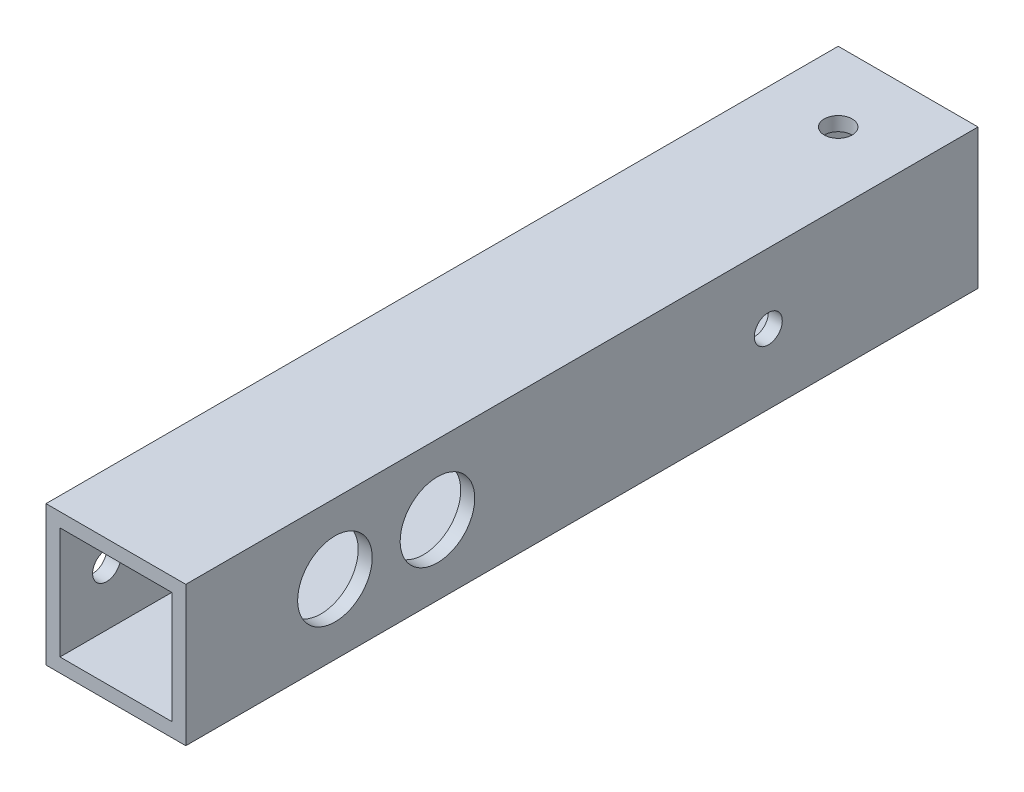
ISO-10303-21;
HEADER;
FILE_DESCRIPTION(('STEP AP214'),'2;1');
FILE_NAME('part.step','',(''),(''),'','','');
FILE_SCHEMA(('AUTOMOTIVE_DESIGN { 1 0 10303 214 1 1 1 1 }'));
ENDSEC;
DATA;
#1=APPLICATION_CONTEXT('core data for automotive mechanical design processes');
#2=APPLICATION_PROTOCOL_DEFINITION('international standard','automotive_design',2000,#1);
#3=PRODUCT_CONTEXT('',#1,'mechanical');
#4=PRODUCT('Part','Part','',(#3));
#5=PRODUCT_RELATED_PRODUCT_CATEGORY('part','',(#4));
#6=PRODUCT_DEFINITION_FORMATION('','',#4);
#7=PRODUCT_DEFINITION_CONTEXT('part definition',#1,'design');
#8=PRODUCT_DEFINITION('design','',#6,#7);
#9=PRODUCT_DEFINITION_SHAPE('','',#8);
#10=(LENGTH_UNIT() NAMED_UNIT(*) SI_UNIT(.MILLI.,.METRE.));
#11=(NAMED_UNIT(*) PLANE_ANGLE_UNIT() SI_UNIT($,.RADIAN.));
#12=(NAMED_UNIT(*) SI_UNIT($,.STERADIAN.) SOLID_ANGLE_UNIT());
#13=UNCERTAINTY_MEASURE_WITH_UNIT(LENGTH_MEASURE(1.E-05),#10,'distance_accuracy_value','');
#14=(GEOMETRIC_REPRESENTATION_CONTEXT(3) GLOBAL_UNCERTAINTY_ASSIGNED_CONTEXT((#13)) GLOBAL_UNIT_ASSIGNED_CONTEXT((#10,
#11,#12)) REPRESENTATION_CONTEXT('',''));
#15=CARTESIAN_POINT('',(0.,0.,0.));
#16=DIRECTION('',(0.,0.,1.));
#17=DIRECTION('',(1.,0.,0.));
#18=AXIS2_PLACEMENT_3D('',#15,#16,#17);
#19=CARTESIAN_POINT('',(0.,0.,-85.));
#20=DIRECTION('',(0.,0.,-1.));
#21=DIRECTION('',(1.,0.,0.));
#22=AXIS2_PLACEMENT_3D('',#19,#20,#21);
#23=PLANE('',#22);
#24=DIRECTION('',(0.,-1.,0.));
#25=VECTOR('',#24,1.);
#26=CARTESIAN_POINT('',(-7.01008414074451,7.73262608579252,-85.));
#27=LINE('',#26,#25);
#28=CARTESIAN_POINT('',(-7.01008414074451,7.73262608579252,-85.));
#29=VERTEX_POINT('',#28);
#30=CARTESIAN_POINT('',(-7.01008414074451,-7.26737391420748,-85.));
#31=VERTEX_POINT('',#30);
#32=EDGE_CURVE('E138',#29,#31,#27,.T.);
#33=ORIENTED_EDGE('',*,*,#32,.F.);
#34=DIRECTION('',(-1.,0.,0.));
#35=VECTOR('',#34,1.);
#36=CARTESIAN_POINT('',(-7.01008414074451,7.73262608579252,-85.));
#37=LINE('',#36,#35);
#38=CARTESIAN_POINT('',(7.98991585925549,7.73262608579252,-85.));
#39=VERTEX_POINT('',#38);
#40=EDGE_CURVE('E148',#39,#29,#37,.T.);
#41=ORIENTED_EDGE('',*,*,#40,.F.);
#42=DIRECTION('',(0.,1.,0.));
#43=VECTOR('',#42,1.);
#44=CARTESIAN_POINT('',(7.98991585925549,7.73262608579252,-85.));
#45=LINE('',#44,#43);
#46=CARTESIAN_POINT('',(7.98991585925548,-7.26737391420748,-85.));
#47=VERTEX_POINT('',#46);
#48=EDGE_CURVE('E145',#47,#39,#45,.T.);
#49=ORIENTED_EDGE('',*,*,#48,.F.);
#50=DIRECTION('',(1.,0.,0.));
#51=VECTOR('',#50,1.);
#52=CARTESIAN_POINT('',(-7.01008414074451,-7.26737391420748,-85.));
#53=LINE('',#52,#51);
#54=EDGE_CURVE('E141',#31,#47,#53,.T.);
#55=ORIENTED_EDGE('',*,*,#54,.F.);
#56=EDGE_LOOP('',(#33,#41,#49,#55));
#57=FACE_BOUND('',#56,.T.);
#58=DIRECTION('',(1.,0.,0.));
#59=VECTOR('',#58,1.);
#60=CARTESIAN_POINT('',(-5.51008414074451,-5.76737391420748,-85.));
#61=LINE('',#60,#59);
#62=CARTESIAN_POINT('',(-5.51008414074451,-5.76737391420748,-85.));
#63=VERTEX_POINT('',#62);
#64=CARTESIAN_POINT('',(6.48991585925549,-5.76737391420748,-85.));
#65=VERTEX_POINT('',#64);
#66=EDGE_CURVE('E117',#63,#65,#61,.T.);
#67=ORIENTED_EDGE('',*,*,#66,.T.);
#68=DIRECTION('',(0.,1.,0.));
#69=VECTOR('',#68,1.);
#70=CARTESIAN_POINT('',(6.48991585925549,6.23262608579252,-85.));
#71=LINE('',#70,#69);
#72=CARTESIAN_POINT('',(6.48991585925549,6.23262608579252,-85.));
#73=VERTEX_POINT('',#72);
#74=EDGE_CURVE('E122',#65,#73,#71,.T.);
#75=ORIENTED_EDGE('',*,*,#74,.T.);
#76=DIRECTION('',(-1.,0.,0.));
#77=VECTOR('',#76,1.);
#78=CARTESIAN_POINT('',(-5.51008414074451,6.23262608579252,-85.));
#79=LINE('',#78,#77);
#80=CARTESIAN_POINT('',(-5.51008414074451,6.23262608579252,-85.));
#81=VERTEX_POINT('',#80);
#82=EDGE_CURVE('E118',#73,#81,#79,.T.);
#83=ORIENTED_EDGE('',*,*,#82,.T.);
#84=DIRECTION('',(0.,-1.,0.));
#85=VECTOR('',#84,1.);
#86=CARTESIAN_POINT('',(-5.51008414074451,6.23262608579252,-85.));
#87=LINE('',#86,#85);
#88=EDGE_CURVE('E103',#81,#63,#87,.T.);
#89=ORIENTED_EDGE('',*,*,#88,.T.);
#90=EDGE_LOOP('',(#67,#75,#83,#89));
#91=FACE_BOUND('',#90,.T.);
#92=ADVANCED_FACE('F35',(#57,#91),#23,.T.);
#93=CARTESIAN_POINT('',(0.,0.,0.));
#94=DIRECTION('',(0.,0.,-1.));
#95=DIRECTION('',(1.,0.,0.));
#96=AXIS2_PLACEMENT_3D('',#93,#94,#95);
#97=PLANE('',#96);
#98=DIRECTION('',(0.,-1.,0.));
#99=VECTOR('',#98,1.);
#100=CARTESIAN_POINT('',(-7.01008414074451,7.73262608579252,0.));
#101=LINE('',#100,#99);
#102=CARTESIAN_POINT('',(-7.01008414074451,7.73262608579252,0.));
#103=VERTEX_POINT('',#102);
#104=CARTESIAN_POINT('',(-7.01008414074451,-7.26737391420748,0.));
#105=VERTEX_POINT('',#104);
#106=EDGE_CURVE('E111',#103,#105,#101,.T.);
#107=ORIENTED_EDGE('',*,*,#106,.T.);
#108=DIRECTION('',(1.,0.,0.));
#109=VECTOR('',#108,1.);
#110=CARTESIAN_POINT('',(-7.01008414074451,-7.26737391420748,0.));
#111=LINE('',#110,#109);
#112=CARTESIAN_POINT('',(7.98991585925548,-7.26737391420748,0.));
#113=VERTEX_POINT('',#112);
#114=EDGE_CURVE('E154',#105,#113,#111,.T.);
#115=ORIENTED_EDGE('',*,*,#114,.T.);
#116=DIRECTION('',(0.,1.,0.));
#117=VECTOR('',#116,1.);
#118=CARTESIAN_POINT('',(7.98991585925549,7.73262608579252,0.));
#119=LINE('',#118,#117);
#120=CARTESIAN_POINT('',(7.98991585925549,7.73262608579252,0.));
#121=VERTEX_POINT('',#120);
#122=EDGE_CURVE('E157',#113,#121,#119,.T.);
#123=ORIENTED_EDGE('',*,*,#122,.T.);
#124=DIRECTION('',(-1.,0.,0.));
#125=VECTOR('',#124,1.);
#126=CARTESIAN_POINT('',(-7.01008414074451,7.73262608579252,0.));
#127=LINE('',#126,#125);
#128=EDGE_CURVE('E142',#121,#103,#127,.T.);
#129=ORIENTED_EDGE('',*,*,#128,.T.);
#130=EDGE_LOOP('',(#107,#115,#123,#129));
#131=FACE_BOUND('',#130,.T.);
#132=DIRECTION('',(0.,-1.,0.));
#133=VECTOR('',#132,1.);
#134=CARTESIAN_POINT('',(-5.51008414074451,6.23262608579252,0.));
#135=LINE('',#134,#133);
#136=CARTESIAN_POINT('',(-5.51008414074451,6.23262608579252,0.));
#137=VERTEX_POINT('',#136);
#138=CARTESIAN_POINT('',(-5.51008414074451,-5.76737391420748,0.));
#139=VERTEX_POINT('',#138);
#140=EDGE_CURVE('E106',#137,#139,#135,.T.);
#141=ORIENTED_EDGE('',*,*,#140,.F.);
#142=DIRECTION('',(-1.,0.,0.));
#143=VECTOR('',#142,1.);
#144=CARTESIAN_POINT('',(-5.51008414074451,6.23262608579252,0.));
#145=LINE('',#144,#143);
#146=CARTESIAN_POINT('',(6.48991585925549,6.23262608579252,0.));
#147=VERTEX_POINT('',#146);
#148=EDGE_CURVE('E119',#147,#137,#145,.T.);
#149=ORIENTED_EDGE('',*,*,#148,.F.);
#150=DIRECTION('',(0.,1.,0.));
#151=VECTOR('',#150,1.);
#152=CARTESIAN_POINT('',(6.48991585925549,6.23262608579252,0.));
#153=LINE('',#152,#151);
#154=CARTESIAN_POINT('',(6.48991585925549,-5.76737391420748,0.));
#155=VERTEX_POINT('',#154);
#156=EDGE_CURVE('E132',#155,#147,#153,.T.);
#157=ORIENTED_EDGE('',*,*,#156,.F.);
#158=DIRECTION('',(1.,0.,0.));
#159=VECTOR('',#158,1.);
#160=CARTESIAN_POINT('',(-5.51008414074451,-5.76737391420748,0.));
#161=LINE('',#160,#159);
#162=EDGE_CURVE('E129',#139,#155,#161,.T.);
#163=ORIENTED_EDGE('',*,*,#162,.F.);
#164=EDGE_LOOP('',(#141,#149,#157,#163));
#165=FACE_BOUND('',#164,.T.);
#166=ADVANCED_FACE('F241',(#131,#165),#97,.F.);
#167=CARTESIAN_POINT('',(-7.01008414074451,7.73262608579252,-85.));
#168=DIRECTION('',(1.,0.,0.));
#169=DIRECTION('',(0.,1.,0.));
#170=AXIS2_PLACEMENT_3D('',#167,#168,#169);
#171=PLANE('',#170);
#172=CARTESIAN_POINT('',(-7.01008414074451,0.232626085792518,-27.));
#173=DIRECTION('',(1.,0.,0.));
#174=DIRECTION('',(0.,-1.,0.));
#175=AXIS2_PLACEMENT_3D('',#172,#173,#174);
#176=CIRCLE('',#175,1.5);
#177=CARTESIAN_POINT('',(-7.01008414074451,-1.26737391420748,-27.));
#178=VERTEX_POINT('',#177);
#179=EDGE_CURVE('E191',#178,#178,#176,.T.);
#180=ORIENTED_EDGE('',*,*,#179,.T.);
#181=EDGE_LOOP('',(#180));
#182=FACE_BOUND('',#181,.T.);
#183=CARTESIAN_POINT('',(-7.01008414074451,0.232626085792519,-5.));
#184=DIRECTION('',(1.,0.,0.));
#185=DIRECTION('',(0.,-1.,0.));
#186=AXIS2_PLACEMENT_3D('',#183,#184,#185);
#187=CIRCLE('',#186,1.5);
#188=CARTESIAN_POINT('',(-7.01008414074451,-1.26737391420748,-5.));
#189=VERTEX_POINT('',#188);
#190=EDGE_CURVE('E188',#189,#189,#187,.T.);
#191=ORIENTED_EDGE('',*,*,#190,.T.);
#192=EDGE_LOOP('',(#191));
#193=FACE_BOUND('',#192,.T.);
#194=CARTESIAN_POINT('',(-7.01008414074451,0.232626085792518,-16.));
#195=DIRECTION('',(1.,0.,0.));
#196=DIRECTION('',(0.,-1.,0.));
#197=AXIS2_PLACEMENT_3D('',#194,#195,#196);
#198=CIRCLE('',#197,3.);
#199=CARTESIAN_POINT('',(-7.01008414074451,-2.76737391420748,-16.));
#200=VERTEX_POINT('',#199);
#201=EDGE_CURVE('E184',#200,#200,#198,.T.);
#202=ORIENTED_EDGE('',*,*,#201,.T.);
#203=EDGE_LOOP('',(#202));
#204=FACE_BOUND('',#203,.T.);
#205=CARTESIAN_POINT('',(-7.01008414074451,0.232626085792516,-62.5));
#206=DIRECTION('',(1.,0.,0.));
#207=DIRECTION('',(0.,-1.,0.));
#208=AXIS2_PLACEMENT_3D('',#205,#206,#207);
#209=CIRCLE('',#208,4.00000000000001);
#210=CARTESIAN_POINT('',(-7.01008414074451,-3.76737391420749,-62.5));
#211=VERTEX_POINT('',#210);
#212=EDGE_CURVE('E180',#211,#211,#209,.T.);
#213=ORIENTED_EDGE('',*,*,#212,.T.);
#214=EDGE_LOOP('',(#213));
#215=FACE_BOUND('',#214,.T.);
#216=ORIENTED_EDGE('',*,*,#106,.F.);
#217=DIRECTION('',(0.,0.,1.));
#218=VECTOR('',#217,1.);
#219=CARTESIAN_POINT('',(-7.01008414074451,7.73262608579252,-85.));
#220=LINE('',#219,#218);
#221=EDGE_CURVE('E151',#29,#103,#220,.T.);
#222=ORIENTED_EDGE('',*,*,#221,.F.);
#223=ORIENTED_EDGE('',*,*,#32,.T.);
#224=DIRECTION('',(0.,0.,1.));
#225=VECTOR('',#224,1.);
#226=CARTESIAN_POINT('',(-7.01008414074451,-7.26737391420748,-85.));
#227=LINE('',#226,#225);
#228=EDGE_CURVE('E11',#31,#105,#227,.T.);
#229=ORIENTED_EDGE('',*,*,#228,.T.);
#230=EDGE_LOOP('',(#216,#222,#223,#229));
#231=FACE_BOUND('',#230,.T.);
#232=ADVANCED_FACE('F37',(#182,#193,#204,#215,#231),#171,.F.);
#233=CARTESIAN_POINT('',(-7.01008414074451,-7.26737391420748,-85.));
#234=DIRECTION('',(0.,1.,0.));
#235=DIRECTION('',(0.,0.,-1.));
#236=AXIS2_PLACEMENT_3D('',#233,#234,#235);
#237=PLANE('',#236);
#238=CARTESIAN_POINT('',(0.489915859255487,-7.26737391420748,-77.5));
#239=DIRECTION('',(0.,1.,0.));
#240=DIRECTION('',(0.,0.,1.));
#241=AXIS2_PLACEMENT_3D('',#238,#239,#240);
#242=CIRCLE('',#241,4.);
#243=CARTESIAN_POINT('',(0.489915859255487,-7.26737391420748,-73.5));
#244=VERTEX_POINT('',#243);
#245=EDGE_CURVE('E176',#244,#244,#242,.T.);
#246=ORIENTED_EDGE('',*,*,#245,.T.);
#247=EDGE_LOOP('',(#246));
#248=FACE_BOUND('',#247,.T.);
#249=ORIENTED_EDGE('',*,*,#114,.F.);
#250=ORIENTED_EDGE('',*,*,#228,.F.);
#251=ORIENTED_EDGE('',*,*,#54,.T.);
#252=DIRECTION('',(0.,0.,1.));
#253=VECTOR('',#252,1.);
#254=CARTESIAN_POINT('',(7.98991585925548,-7.26737391420748,-85.));
#255=LINE('',#254,#253);
#256=EDGE_CURVE('E44',#47,#113,#255,.T.);
#257=ORIENTED_EDGE('',*,*,#256,.T.);
#258=EDGE_LOOP('',(#249,#250,#251,#257));
#259=FACE_BOUND('',#258,.T.);
#260=ADVANCED_FACE('F257',(#248,#259),#237,.F.);
#261=CARTESIAN_POINT('',(7.98991585925549,7.73262608579252,-85.));
#262=DIRECTION('',(-1.,0.,0.));
#263=DIRECTION('',(0.,-1.,0.));
#264=AXIS2_PLACEMENT_3D('',#261,#262,#263);
#265=PLANE('',#264);
#266=CARTESIAN_POINT('',(7.98991585925548,0.232626085792515,-16.));
#267=DIRECTION('',(-1.,0.,0.));
#268=DIRECTION('',(0.,1.,0.));
#269=AXIS2_PLACEMENT_3D('',#266,#267,#268);
#270=CIRCLE('',#269,4.);
#271=CARTESIAN_POINT('',(7.98991585925549,4.23262608579252,-16.));
#272=VERTEX_POINT('',#271);
#273=EDGE_CURVE('E194',#272,#272,#270,.T.);
#274=ORIENTED_EDGE('',*,*,#273,.T.);
#275=EDGE_LOOP('',(#274));
#276=FACE_BOUND('',#275,.T.);
#277=CARTESIAN_POINT('',(7.98991585925548,0.232626085792515,-27.));
#278=DIRECTION('',(-1.,0.,0.));
#279=DIRECTION('',(0.,1.,0.));
#280=AXIS2_PLACEMENT_3D('',#277,#278,#279);
#281=CIRCLE('',#280,4.);
#282=CARTESIAN_POINT('',(7.98991585925549,4.23262608579251,-27.));
#283=VERTEX_POINT('',#282);
#284=EDGE_CURVE('E199',#283,#283,#281,.T.);
#285=ORIENTED_EDGE('',*,*,#284,.T.);
#286=EDGE_LOOP('',(#285));
#287=FACE_BOUND('',#286,.T.);
#288=CARTESIAN_POINT('',(7.98991585925548,0.232626085792518,-62.5));
#289=DIRECTION('',(-1.,0.,0.));
#290=DIRECTION('',(0.,1.,0.));
#291=AXIS2_PLACEMENT_3D('',#288,#289,#290);
#292=CIRCLE('',#291,1.5);
#293=CARTESIAN_POINT('',(7.98991585925548,1.73262608579252,-62.5));
#294=VERTEX_POINT('',#293);
#295=EDGE_CURVE('E172',#294,#294,#292,.T.);
#296=ORIENTED_EDGE('',*,*,#295,.T.);
#297=EDGE_LOOP('',(#296));
#298=FACE_BOUND('',#297,.T.);
#299=ORIENTED_EDGE('',*,*,#122,.F.);
#300=ORIENTED_EDGE('',*,*,#256,.F.);
#301=ORIENTED_EDGE('',*,*,#48,.T.);
#302=DIRECTION('',(0.,0.,1.));
#303=VECTOR('',#302,1.);
#304=CARTESIAN_POINT('',(7.98991585925549,7.73262608579252,-85.));
#305=LINE('',#304,#303);
#306=EDGE_CURVE('E163',#39,#121,#305,.T.);
#307=ORIENTED_EDGE('',*,*,#306,.T.);
#308=EDGE_LOOP('',(#299,#300,#301,#307));
#309=FACE_BOUND('',#308,.T.);
#310=ADVANCED_FACE('F255',(#276,#287,#298,#309),#265,.F.);
#311=CARTESIAN_POINT('',(-7.01008414074451,7.73262608579252,-85.));
#312=DIRECTION('',(0.,-1.,0.));
#313=DIRECTION('',(0.,0.,1.));
#314=AXIS2_PLACEMENT_3D('',#311,#312,#313);
#315=PLANE('',#314);
#316=CARTESIAN_POINT('',(0.489915859255487,7.73262608579252,-77.5));
#317=DIRECTION('',(0.,-1.,0.));
#318=DIRECTION('',(0.,0.,-1.));
#319=AXIS2_PLACEMENT_3D('',#316,#317,#318);
#320=CIRCLE('',#319,1.5);
#321=CARTESIAN_POINT('',(0.489915859255487,7.73262608579252,-79.));
#322=VERTEX_POINT('',#321);
#323=EDGE_CURVE('E168',#322,#322,#320,.T.);
#324=ORIENTED_EDGE('',*,*,#323,.T.);
#325=EDGE_LOOP('',(#324));
#326=FACE_BOUND('',#325,.T.);
#327=ORIENTED_EDGE('',*,*,#128,.F.);
#328=ORIENTED_EDGE('',*,*,#306,.F.);
#329=ORIENTED_EDGE('',*,*,#40,.T.);
#330=ORIENTED_EDGE('',*,*,#221,.T.);
#331=EDGE_LOOP('',(#327,#328,#329,#330));
#332=FACE_BOUND('',#331,.T.);
#333=ADVANCED_FACE('F220',(#326,#332),#315,.F.);
#334=CARTESIAN_POINT('',(-5.51008414074451,6.23262608579252,-85.));
#335=DIRECTION('',(1.,0.,0.));
#336=DIRECTION('',(0.,1.,0.));
#337=AXIS2_PLACEMENT_3D('',#334,#335,#336);
#338=PLANE('',#337);
#339=CARTESIAN_POINT('',(-5.51008414074451,0.232626085792519,-27.));
#340=DIRECTION('',(-1.,0.,0.));
#341=DIRECTION('',(0.,1.,0.));
#342=AXIS2_PLACEMENT_3D('',#339,#340,#341);
#343=CIRCLE('',#342,1.5);
#344=CARTESIAN_POINT('',(-5.51008414074451,1.73262608579252,-27.));
#345=VERTEX_POINT('',#344);
#346=EDGE_CURVE('E189',#345,#345,#343,.T.);
#347=ORIENTED_EDGE('',*,*,#346,.T.);
#348=EDGE_LOOP('',(#347));
#349=FACE_BOUND('',#348,.T.);
#350=CARTESIAN_POINT('',(-5.51008414074451,0.232626085792519,-5.));
#351=DIRECTION('',(-1.,0.,0.));
#352=DIRECTION('',(0.,1.,0.));
#353=AXIS2_PLACEMENT_3D('',#350,#351,#352);
#354=CIRCLE('',#353,1.5);
#355=CARTESIAN_POINT('',(-5.51008414074451,1.73262608579252,-5.));
#356=VERTEX_POINT('',#355);
#357=EDGE_CURVE('E185',#356,#356,#354,.T.);
#358=ORIENTED_EDGE('',*,*,#357,.T.);
#359=EDGE_LOOP('',(#358));
#360=FACE_BOUND('',#359,.T.);
#361=CARTESIAN_POINT('',(-5.51008414074451,0.232626085792519,-16.));
#362=DIRECTION('',(-1.,0.,0.));
#363=DIRECTION('',(0.,1.,0.));
#364=AXIS2_PLACEMENT_3D('',#361,#362,#363);
#365=CIRCLE('',#364,3.);
#366=CARTESIAN_POINT('',(-5.51008414074451,3.23262608579252,-16.));
#367=VERTEX_POINT('',#366);
#368=EDGE_CURVE('E181',#367,#367,#365,.T.);
#369=ORIENTED_EDGE('',*,*,#368,.T.);
#370=EDGE_LOOP('',(#369));
#371=FACE_BOUND('',#370,.T.);
#372=CARTESIAN_POINT('',(-5.51008414074451,0.232626085792516,-62.5));
#373=DIRECTION('',(-1.,0.,0.));
#374=DIRECTION('',(0.,1.,0.));
#375=AXIS2_PLACEMENT_3D('',#372,#373,#374);
#376=CIRCLE('',#375,4.00000000000001);
#377=CARTESIAN_POINT('',(-5.51008414074451,4.23262608579252,-62.5));
#378=VERTEX_POINT('',#377);
#379=EDGE_CURVE('E177',#378,#378,#376,.T.);
#380=ORIENTED_EDGE('',*,*,#379,.T.);
#381=EDGE_LOOP('',(#380));
#382=FACE_BOUND('',#381,.T.);
#383=ORIENTED_EDGE('',*,*,#140,.T.);
#384=DIRECTION('',(0.,0.,1.));
#385=VECTOR('',#384,1.);
#386=CARTESIAN_POINT('',(-5.51008414074451,-5.76737391420748,-85.));
#387=LINE('',#386,#385);
#388=EDGE_CURVE('E100',#63,#139,#387,.T.);
#389=ORIENTED_EDGE('',*,*,#388,.F.);
#390=ORIENTED_EDGE('',*,*,#88,.F.);
#391=DIRECTION('',(0.,0.,1.));
#392=VECTOR('',#391,1.);
#393=CARTESIAN_POINT('',(-5.51008414074451,6.23262608579252,-85.));
#394=LINE('',#393,#392);
#395=EDGE_CURVE('E60',#81,#137,#394,.T.);
#396=ORIENTED_EDGE('',*,*,#395,.T.);
#397=EDGE_LOOP('',(#383,#389,#390,#396));
#398=FACE_BOUND('',#397,.T.);
#399=ADVANCED_FACE('F102',(#349,#360,#371,#382,#398),#338,.T.);
#400=CARTESIAN_POINT('',(-5.51008414074451,-5.76737391420748,-85.));
#401=DIRECTION('',(0.,1.,0.));
#402=DIRECTION('',(0.,0.,-1.));
#403=AXIS2_PLACEMENT_3D('',#400,#401,#402);
#404=PLANE('',#403);
#405=CARTESIAN_POINT('',(0.489915859255487,-5.76737391420748,-77.5));
#406=DIRECTION('',(0.,-1.,0.));
#407=DIRECTION('',(0.,0.,-1.));
#408=AXIS2_PLACEMENT_3D('',#405,#406,#407);
#409=CIRCLE('',#408,4.);
#410=CARTESIAN_POINT('',(0.489915859255487,-5.76737391420748,-81.5));
#411=VERTEX_POINT('',#410);
#412=EDGE_CURVE('E173',#411,#411,#409,.T.);
#413=ORIENTED_EDGE('',*,*,#412,.T.);
#414=EDGE_LOOP('',(#413));
#415=FACE_BOUND('',#414,.T.);
#416=ORIENTED_EDGE('',*,*,#162,.T.);
#417=DIRECTION('',(0.,0.,1.));
#418=VECTOR('',#417,1.);
#419=CARTESIAN_POINT('',(6.48991585925549,-5.76737391420748,-85.));
#420=LINE('',#419,#418);
#421=EDGE_CURVE('E112',#65,#155,#420,.T.);
#422=ORIENTED_EDGE('',*,*,#421,.F.);
#423=ORIENTED_EDGE('',*,*,#66,.F.);
#424=ORIENTED_EDGE('',*,*,#388,.T.);
#425=EDGE_LOOP('',(#416,#422,#423,#424));
#426=FACE_BOUND('',#425,.T.);
#427=ADVANCED_FACE('F121',(#415,#426),#404,.T.);
#428=CARTESIAN_POINT('',(6.48991585925549,6.23262608579252,-85.));
#429=DIRECTION('',(-1.,0.,0.));
#430=DIRECTION('',(0.,-1.,0.));
#431=AXIS2_PLACEMENT_3D('',#428,#429,#430);
#432=PLANE('',#431);
#433=CARTESIAN_POINT('',(6.48991585925549,0.232626085792515,-16.));
#434=DIRECTION('',(1.,0.,0.));
#435=DIRECTION('',(0.,-1.,0.));
#436=AXIS2_PLACEMENT_3D('',#433,#434,#435);
#437=CIRCLE('',#436,4.);
#438=CARTESIAN_POINT('',(6.48991585925549,-3.76737391420749,-16.));
#439=VERTEX_POINT('',#438);
#440=EDGE_CURVE('E39',#439,#439,#437,.T.);
#441=ORIENTED_EDGE('',*,*,#440,.T.);
#442=EDGE_LOOP('',(#441));
#443=FACE_BOUND('',#442,.T.);
#444=CARTESIAN_POINT('',(6.48991585925549,0.232626085792515,-27.));
#445=DIRECTION('',(1.,0.,0.));
#446=DIRECTION('',(0.,-1.,0.));
#447=AXIS2_PLACEMENT_3D('',#444,#445,#446);
#448=CIRCLE('',#447,4.);
#449=CARTESIAN_POINT('',(6.48991585925549,-3.76737391420748,-27.));
#450=VERTEX_POINT('',#449);
#451=EDGE_CURVE('E192',#450,#450,#448,.T.);
#452=ORIENTED_EDGE('',*,*,#451,.T.);
#453=EDGE_LOOP('',(#452));
#454=FACE_BOUND('',#453,.T.);
#455=CARTESIAN_POINT('',(6.48991585925549,0.232626085792519,-62.5));
#456=DIRECTION('',(1.,0.,0.));
#457=DIRECTION('',(0.,-1.,0.));
#458=AXIS2_PLACEMENT_3D('',#455,#456,#457);
#459=CIRCLE('',#458,1.5);
#460=CARTESIAN_POINT('',(6.48991585925549,-1.26737391420748,-62.5));
#461=VERTEX_POINT('',#460);
#462=EDGE_CURVE('E169',#461,#461,#459,.T.);
#463=ORIENTED_EDGE('',*,*,#462,.T.);
#464=EDGE_LOOP('',(#463));
#465=FACE_BOUND('',#464,.T.);
#466=ORIENTED_EDGE('',*,*,#156,.T.);
#467=DIRECTION('',(0.,0.,1.));
#468=VECTOR('',#467,1.);
#469=CARTESIAN_POINT('',(6.48991585925549,6.23262608579252,-85.));
#470=LINE('',#469,#468);
#471=EDGE_CURVE('E52',#73,#147,#470,.T.);
#472=ORIENTED_EDGE('',*,*,#471,.F.);
#473=ORIENTED_EDGE('',*,*,#74,.F.);
#474=ORIENTED_EDGE('',*,*,#421,.T.);
#475=EDGE_LOOP('',(#466,#472,#473,#474));
#476=FACE_BOUND('',#475,.T.);
#477=ADVANCED_FACE('F236',(#443,#454,#465,#476),#432,.T.);
#478=CARTESIAN_POINT('',(-5.51008414074451,6.23262608579252,-85.));
#479=DIRECTION('',(0.,-1.,0.));
#480=DIRECTION('',(0.,0.,1.));
#481=AXIS2_PLACEMENT_3D('',#478,#479,#480);
#482=PLANE('',#481);
#483=CARTESIAN_POINT('',(0.489915859255487,6.23262608579252,-77.5));
#484=DIRECTION('',(0.,1.,0.));
#485=DIRECTION('',(0.,0.,1.));
#486=AXIS2_PLACEMENT_3D('',#483,#484,#485);
#487=CIRCLE('',#486,1.5);
#488=CARTESIAN_POINT('',(0.489915859255487,6.23262608579252,-76.));
#489=VERTEX_POINT('',#488);
#490=EDGE_CURVE('E130',#489,#489,#487,.T.);
#491=ORIENTED_EDGE('',*,*,#490,.T.);
#492=EDGE_LOOP('',(#491));
#493=FACE_BOUND('',#492,.T.);
#494=ORIENTED_EDGE('',*,*,#148,.T.);
#495=ORIENTED_EDGE('',*,*,#395,.F.);
#496=ORIENTED_EDGE('',*,*,#82,.F.);
#497=ORIENTED_EDGE('',*,*,#471,.T.);
#498=EDGE_LOOP('',(#494,#495,#496,#497));
#499=FACE_BOUND('',#498,.T.);
#500=ADVANCED_FACE('F226',(#493,#499),#482,.T.);
#501=CARTESIAN_POINT('',(0.489915859255487,-2.26737391420748,-77.5));
#502=DIRECTION('',(0.,1.,0.));
#503=DIRECTION('',(0.,0.,-1.));
#504=AXIS2_PLACEMENT_3D('',#501,#502,#503);
#505=CYLINDRICAL_SURFACE('',#504,1.5);
#506=ORIENTED_EDGE('',*,*,#490,.F.);
#507=EDGE_LOOP('',(#506));
#508=FACE_BOUND('',#507,.T.);
#509=ORIENTED_EDGE('',*,*,#323,.F.);
#510=EDGE_LOOP('',(#509));
#511=FACE_BOUND('',#510,.T.);
#512=ADVANCED_FACE('F223',(#508,#511),#505,.F.);
#513=CARTESIAN_POINT('',(-2.01008414074452,0.232626085792521,-62.5));
#514=DIRECTION('',(1.,0.,0.));
#515=DIRECTION('',(0.,1.,0.));
#516=AXIS2_PLACEMENT_3D('',#513,#514,#515);
#517=CYLINDRICAL_SURFACE('',#516,1.5);
#518=ORIENTED_EDGE('',*,*,#462,.F.);
#519=EDGE_LOOP('',(#518));
#520=FACE_BOUND('',#519,.T.);
#521=ORIENTED_EDGE('',*,*,#295,.F.);
#522=EDGE_LOOP('',(#521));
#523=FACE_BOUND('',#522,.T.);
#524=ADVANCED_FACE('F225',(#520,#523),#517,.F.);
#525=CARTESIAN_POINT('',(0.489915859255487,2.73262608579252,-77.5));
#526=DIRECTION('',(0.,-1.,0.));
#527=DIRECTION('',(0.,0.,1.));
#528=AXIS2_PLACEMENT_3D('',#525,#526,#527);
#529=CYLINDRICAL_SURFACE('',#528,4.);
#530=ORIENTED_EDGE('',*,*,#412,.F.);
#531=EDGE_LOOP('',(#530));
#532=FACE_BOUND('',#531,.T.);
#533=ORIENTED_EDGE('',*,*,#245,.F.);
#534=EDGE_LOOP('',(#533));
#535=FACE_BOUND('',#534,.T.);
#536=ADVANCED_FACE('F233',(#532,#535),#529,.F.);
#537=CARTESIAN_POINT('',(2.98991585925549,0.232626085792518,-62.5));
#538=DIRECTION('',(-1.,0.,0.));
#539=DIRECTION('',(0.,-1.,0.));
#540=AXIS2_PLACEMENT_3D('',#537,#538,#539);
#541=CYLINDRICAL_SURFACE('',#540,4.00000000000001);
#542=ORIENTED_EDGE('',*,*,#379,.F.);
#543=EDGE_LOOP('',(#542));
#544=FACE_BOUND('',#543,.T.);
#545=ORIENTED_EDGE('',*,*,#212,.F.);
#546=EDGE_LOOP('',(#545));
#547=FACE_BOUND('',#546,.T.);
#548=ADVANCED_FACE('F314',(#544,#547),#541,.F.);
#549=CARTESIAN_POINT('',(2.98991585925549,0.23262608579252,-16.));
#550=DIRECTION('',(-1.,0.,0.));
#551=DIRECTION('',(0.,-1.,0.));
#552=AXIS2_PLACEMENT_3D('',#549,#550,#551);
#553=CYLINDRICAL_SURFACE('',#552,3.);
#554=ORIENTED_EDGE('',*,*,#368,.F.);
#555=EDGE_LOOP('',(#554));
#556=FACE_BOUND('',#555,.T.);
#557=ORIENTED_EDGE('',*,*,#201,.F.);
#558=EDGE_LOOP('',(#557));
#559=FACE_BOUND('',#558,.T.);
#560=ADVANCED_FACE('F310',(#556,#559),#553,.F.);
#561=CARTESIAN_POINT('',(2.98991585925549,0.232626085792521,-5.));
#562=DIRECTION('',(-1.,0.,0.));
#563=DIRECTION('',(0.,-1.,0.));
#564=AXIS2_PLACEMENT_3D('',#561,#562,#563);
#565=CYLINDRICAL_SURFACE('',#564,1.5);
#566=ORIENTED_EDGE('',*,*,#357,.F.);
#567=EDGE_LOOP('',(#566));
#568=FACE_BOUND('',#567,.T.);
#569=ORIENTED_EDGE('',*,*,#190,.F.);
#570=EDGE_LOOP('',(#569));
#571=FACE_BOUND('',#570,.T.);
#572=ADVANCED_FACE('F306',(#568,#571),#565,.F.);
#573=CARTESIAN_POINT('',(2.98991585925549,0.23262608579252,-27.));
#574=DIRECTION('',(-1.,0.,0.));
#575=DIRECTION('',(0.,-1.,0.));
#576=AXIS2_PLACEMENT_3D('',#573,#574,#575);
#577=CYLINDRICAL_SURFACE('',#576,1.5);
#578=ORIENTED_EDGE('',*,*,#346,.F.);
#579=EDGE_LOOP('',(#578));
#580=FACE_BOUND('',#579,.T.);
#581=ORIENTED_EDGE('',*,*,#179,.F.);
#582=EDGE_LOOP('',(#581));
#583=FACE_BOUND('',#582,.T.);
#584=ADVANCED_FACE('F300',(#580,#583),#577,.F.);
#585=CARTESIAN_POINT('',(-2.01008414074452,0.232626085792517,-27.));
#586=DIRECTION('',(1.,0.,0.));
#587=DIRECTION('',(0.,1.,0.));
#588=AXIS2_PLACEMENT_3D('',#585,#586,#587);
#589=CYLINDRICAL_SURFACE('',#588,4.);
#590=ORIENTED_EDGE('',*,*,#451,.F.);
#591=EDGE_LOOP('',(#590));
#592=FACE_BOUND('',#591,.T.);
#593=ORIENTED_EDGE('',*,*,#284,.F.);
#594=EDGE_LOOP('',(#593));
#595=FACE_BOUND('',#594,.T.);
#596=ADVANCED_FACE('F295',(#592,#595),#589,.F.);
#597=CARTESIAN_POINT('',(-2.01008414074452,0.232626085792517,-16.));
#598=DIRECTION('',(1.,0.,0.));
#599=DIRECTION('',(0.,1.,0.));
#600=AXIS2_PLACEMENT_3D('',#597,#598,#599);
#601=CYLINDRICAL_SURFACE('',#600,4.);
#602=ORIENTED_EDGE('',*,*,#440,.F.);
#603=EDGE_LOOP('',(#602));
#604=FACE_BOUND('',#603,.T.);
#605=ORIENTED_EDGE('',*,*,#273,.F.);
#606=EDGE_LOOP('',(#605));
#607=FACE_BOUND('',#606,.T.);
#608=ADVANCED_FACE('F292',(#604,#607),#601,.F.);
#609=CLOSED_SHELL('',(#92,#166,#232,#260,#310,#333,#399,#427,#477,#500,#512,#524,#536,#548,#560,
#572,#584,#596,#608));
#610=MANIFOLD_SOLID_BREP('B2',#609);
#611=ADVANCED_BREP_SHAPE_REPRESENTATION('',(#18,#610),#14);
#612=SHAPE_DEFINITION_REPRESENTATION(#9,#611);
ENDSEC;
END-ISO-10303-21;
